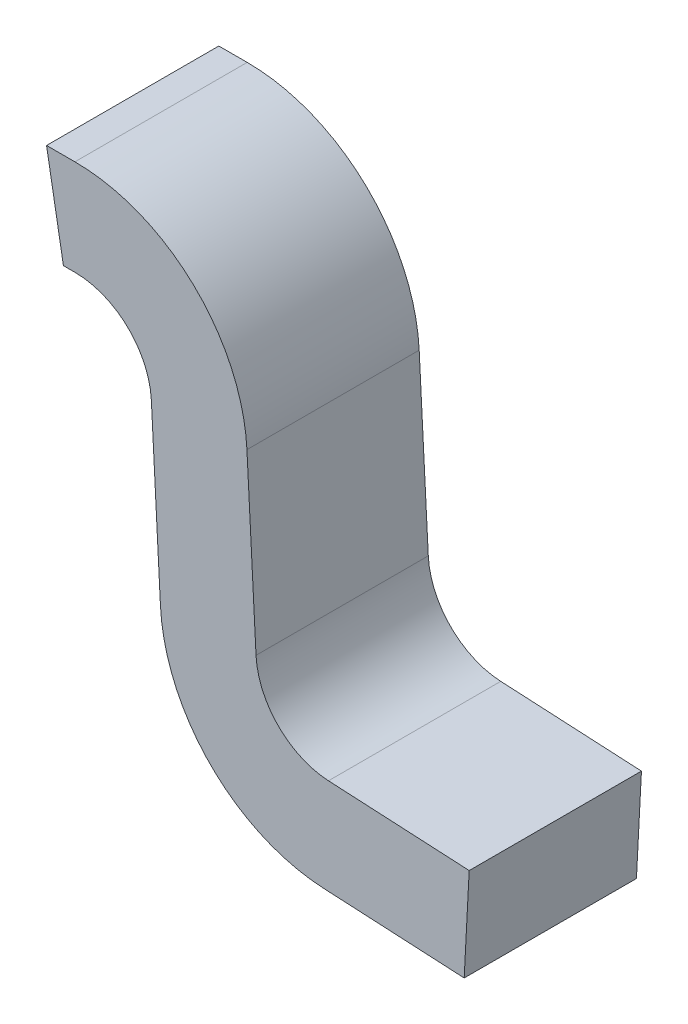
ISO-10303-21;
HEADER;
FILE_DESCRIPTION(('STEP AP214'),'2;1');
FILE_NAME('part.step','',(''),(''),'','','');
FILE_SCHEMA(('AUTOMOTIVE_DESIGN { 1 0 10303 214 1 1 1 1 }'));
ENDSEC;
DATA;
#1=APPLICATION_CONTEXT('core data for automotive mechanical design processes');
#2=APPLICATION_PROTOCOL_DEFINITION('international standard','automotive_design',2000,#1);
#3=PRODUCT_CONTEXT('',#1,'mechanical');
#4=PRODUCT('Part','Part','',(#3));
#5=PRODUCT_RELATED_PRODUCT_CATEGORY('part','',(#4));
#6=PRODUCT_DEFINITION_FORMATION('','',#4);
#7=PRODUCT_DEFINITION_CONTEXT('part definition',#1,'design');
#8=PRODUCT_DEFINITION('design','',#6,#7);
#9=PRODUCT_DEFINITION_SHAPE('','',#8);
#10=(LENGTH_UNIT() NAMED_UNIT(*) SI_UNIT(.MILLI.,.METRE.));
#11=(NAMED_UNIT(*) PLANE_ANGLE_UNIT() SI_UNIT($,.RADIAN.));
#12=(NAMED_UNIT(*) SI_UNIT($,.STERADIAN.) SOLID_ANGLE_UNIT());
#13=UNCERTAINTY_MEASURE_WITH_UNIT(LENGTH_MEASURE(1.E-05),#10,'distance_accuracy_value','');
#14=(GEOMETRIC_REPRESENTATION_CONTEXT(3) GLOBAL_UNCERTAINTY_ASSIGNED_CONTEXT((#13)) GLOBAL_UNIT_ASSIGNED_CONTEXT((#10,
#11,#12)) REPRESENTATION_CONTEXT('',''));
#15=CARTESIAN_POINT('',(0.,0.,0.));
#16=DIRECTION('',(0.,0.,1.));
#17=DIRECTION('',(1.,0.,0.));
#18=AXIS2_PLACEMENT_3D('',#15,#16,#17);
#19=CARTESIAN_POINT('',(0.,0.,-1.4125));
#20=DIRECTION('',(0.,0.,1.));
#21=DIRECTION('',(1.,0.,0.));
#22=AXIS2_PLACEMENT_3D('',#19,#20,#21);
#23=PLANE('',#22);
#24=DIRECTION('',(-0.0523359562429177,0.998629534754575,0.));
#25=VECTOR('',#24,1.);
#26=CARTESIAN_POINT('',(0.861573213012,-0.31493822705,-1.4125));
#27=LINE('',#26,#25);
#28=CARTESIAN_POINT('',(0.861573213012008,-0.31493822705016,-1.4125));
#29=VERTEX_POINT('',#28);
#30=CARTESIAN_POINT('',(0.849691645319655,-0.0882244098453541,-1.4125));
#31=VERTEX_POINT('',#30);
#32=EDGE_CURVE('E144',#29,#31,#27,.T.);
#33=ORIENTED_EDGE('',*,*,#32,.F.);
#34=CARTESIAN_POINT('',(0.961436166488,-0.309704631426,-1.4125));
#35=DIRECTION('',(0.,0.,1.));
#36=DIRECTION('',(1.,0.,0.));
#37=AXIS2_PLACEMENT_3D('',#34,#35,#36);
#38=CIRCLE('',#37,0.1);
#39=CARTESIAN_POINT('',(0.956202570863354,-0.40956758490123,-1.4125));
#40=VERTEX_POINT('',#39);
#41=EDGE_CURVE('E151',#29,#40,#38,.T.);
#42=ORIENTED_EDGE('',*,*,#41,.T.);
#43=DIRECTION('',(-0.998629534754575,0.0523359562429177,0.));
#44=VECTOR('',#43,1.);
#45=CARTESIAN_POINT('',(1.14,-0.4192,-1.4125));
#46=LINE('',#45,#44);
#47=CARTESIAN_POINT('',(1.14000000000012,-0.419200000000006,-1.4125));
#48=VERTEX_POINT('',#47);
#49=EDGE_CURVE('E148',#48,#40,#46,.T.);
#50=ORIENTED_EDGE('',*,*,#49,.F.);
#51=DIRECTION('',(0.0523359562429177,0.998629534754575,0.));
#52=VECTOR('',#51,1.);
#53=CARTESIAN_POINT('',(1.13345800547,-0.544028691844,-1.4125));
#54=LINE('',#53,#52);
#55=CARTESIAN_POINT('',(1.13345800547,-0.544028691843999,-1.4125));
#56=VERTEX_POINT('',#55);
#57=EDGE_CURVE('E155',#56,#48,#54,.T.);
#58=ORIENTED_EDGE('',*,*,#57,.F.);
#59=DIRECTION('',(0.998629534754575,-0.0523359562429177,0.));
#60=VECTOR('',#59,1.);
#61=CARTESIAN_POINT('',(0.949660576333,-0.534396276745,-1.4125));
#62=LINE('',#61,#60);
#63=CARTESIAN_POINT('',(0.949660576333192,-0.53439627674501,-1.4125));
#64=VERTEX_POINT('',#63);
#65=EDGE_CURVE('E160',#64,#56,#62,.T.);
#66=ORIENTED_EDGE('',*,*,#65,.F.);
#67=CARTESIAN_POINT('',(0.961436166488,-0.309704631426,-1.4125));
#68=DIRECTION('',(0.,0.,1.));
#69=DIRECTION('',(1.,0.,0.));
#70=AXIS2_PLACEMENT_3D('',#67,#68,#69);
#71=CIRCLE('',#70,0.225);
#72=CARTESIAN_POINT('',(0.736744521168336,-0.321480221580316,-1.4125));
#73=VERTEX_POINT('',#72);
#74=EDGE_CURVE('E117',#73,#64,#71,.T.);
#75=ORIENTED_EDGE('',*,*,#74,.F.);
#76=DIRECTION('',(0.0523359562429177,-0.998629534754575,0.));
#77=VECTOR('',#76,1.);
#78=CARTESIAN_POINT('',(0.724862953476,-0.09476640437571,-1.4125));
#79=LINE('',#78,#77);
#80=CARTESIAN_POINT('',(0.724862953475999,-0.0947664043756949,-1.4125));
#81=VERTEX_POINT('',#80);
#82=EDGE_CURVE('E114',#81,#73,#79,.T.);
#83=ORIENTED_EDGE('',*,*,#82,.F.);
#84=CARTESIAN_POINT('',(0.625,-0.1,-1.4125));
#85=DIRECTION('',(0.,0.,1.));
#86=DIRECTION('',(1.,0.,0.));
#87=AXIS2_PLACEMENT_3D('',#84,#85,#86);
#88=CIRCLE('',#87,0.1);
#89=CARTESIAN_POINT('',(0.625,0.,-1.4125));
#90=VERTEX_POINT('',#89);
#91=EDGE_CURVE('E20',#81,#90,#88,.T.);
#92=ORIENTED_EDGE('',*,*,#91,.T.);
#93=DIRECTION('',(1.,0.,0.));
#94=VECTOR('',#93,1.);
#95=CARTESIAN_POINT('',(0.61,0.,-1.4125));
#96=LINE('',#95,#94);
#97=CARTESIAN_POINT('',(0.609999999999862,0.,-1.4125));
#98=VERTEX_POINT('',#97);
#99=EDGE_CURVE('E132',#98,#90,#96,.T.);
#100=ORIENTED_EDGE('',*,*,#99,.F.);
#101=DIRECTION('',(0.173648177667033,-0.98480775301219,0.));
#102=VECTOR('',#101,1.);
#103=CARTESIAN_POINT('',(0.587959127411,0.125,-1.4125));
#104=LINE('',#103,#102);
#105=CARTESIAN_POINT('',(0.587959127411,0.125,-1.4125));
#106=VERTEX_POINT('',#105);
#107=EDGE_CURVE('E130',#106,#98,#104,.T.);
#108=ORIENTED_EDGE('',*,*,#107,.F.);
#109=DIRECTION('',(1.,0.,0.));
#110=VECTOR('',#109,1.);
#111=CARTESIAN_POINT('',(0.625,0.125,-1.4125));
#112=LINE('',#111,#110);
#113=CARTESIAN_POINT('',(0.625,0.125,-1.4125));
#114=VERTEX_POINT('',#113);
#115=EDGE_CURVE('E139',#114,#106,#112,.F.);
#116=ORIENTED_EDGE('',*,*,#115,.F.);
#117=CARTESIAN_POINT('',(0.625,-0.1,-1.4125));
#118=DIRECTION('',(0.,0.,1.));
#119=DIRECTION('',(1.,0.,0.));
#120=AXIS2_PLACEMENT_3D('',#117,#118,#119);
#121=CIRCLE('',#120,0.225);
#122=EDGE_CURVE('E180',#31,#114,#121,.T.);
#123=ORIENTED_EDGE('',*,*,#122,.F.);
#124=EDGE_LOOP('',(#33,#42,#50,#58,#66,#75,#83,#92,#100,#108,#116,#123));
#125=FACE_BOUND('',#124,.T.);
#126=ADVANCED_FACE('F17',(#125),#23,.F.);
#127=CARTESIAN_POINT('',(0.625,-0.1,-1.4125));
#128=DIRECTION('',(0.,0.,1.));
#129=DIRECTION('',(1.,0.,0.));
#130=AXIS2_PLACEMENT_3D('',#127,#128,#129);
#131=CYLINDRICAL_SURFACE('',#130,0.1);
#132=CARTESIAN_POINT('',(0.625,-0.1,-1.1875));
#133=DIRECTION('',(0.,0.,1.));
#134=DIRECTION('',(1.,0.,0.));
#135=AXIS2_PLACEMENT_3D('',#132,#133,#134);
#136=CIRCLE('',#135,0.1);
#137=CARTESIAN_POINT('',(0.625,0.,-1.1875));
#138=VERTEX_POINT('',#137);
#139=CARTESIAN_POINT('',(0.724862953476004,-0.0947664043757943,-1.1875));
#140=VERTEX_POINT('',#139);
#141=EDGE_CURVE('E178',#138,#140,#136,.F.);
#142=ORIENTED_EDGE('',*,*,#141,.F.);
#143=DIRECTION('',(0.,0.,-1.));
#144=VECTOR('',#143,1.);
#145=CARTESIAN_POINT('',(0.625,0.,-1.4125));
#146=LINE('',#145,#144);
#147=EDGE_CURVE('E110',#90,#138,#146,.F.);
#148=ORIENTED_EDGE('',*,*,#147,.F.);
#149=ORIENTED_EDGE('',*,*,#91,.F.);
#150=DIRECTION('',(0.,0.,1.));
#151=VECTOR('',#150,1.);
#152=CARTESIAN_POINT('',(0.724862953476,-0.09476640437571,-1.4125));
#153=LINE('',#152,#151);
#154=EDGE_CURVE('E107',#140,#81,#153,.F.);
#155=ORIENTED_EDGE('',*,*,#154,.F.);
#156=EDGE_LOOP('',(#142,#148,#149,#155));
#157=FACE_BOUND('',#156,.T.);
#158=ADVANCED_FACE('F105',(#157),#131,.F.);
#159=CARTESIAN_POINT('',(0.724862953476,-0.09476640437571,-1.4125));
#160=DIRECTION('',(-0.998629534754575,-0.0523359562429177,0.));
#161=DIRECTION('',(0.0523359562429177,-0.998629534754575,0.));
#162=AXIS2_PLACEMENT_3D('',#159,#160,#161);
#163=PLANE('',#162);
#164=ORIENTED_EDGE('',*,*,#154,.T.);
#165=ORIENTED_EDGE('',*,*,#82,.T.);
#166=DIRECTION('',(0.,0.,1.));
#167=VECTOR('',#166,1.);
#168=CARTESIAN_POINT('',(0.736744521168186,-0.32148022157999,-1.4125));
#169=LINE('',#168,#167);
#170=CARTESIAN_POINT('',(0.736744521168099,-0.321480221580105,-1.1875));
#171=VERTEX_POINT('',#170);
#172=EDGE_CURVE('E120',#171,#73,#169,.F.);
#173=ORIENTED_EDGE('',*,*,#172,.F.);
#174=DIRECTION('',(0.0523359562409312,-0.998629534754679,0.));
#175=VECTOR('',#174,1.);
#176=CARTESIAN_POINT('',(0.724862953476,-0.09476640437571,-1.1875));
#177=LINE('',#176,#175);
#178=EDGE_CURVE('E124',#140,#171,#177,.T.);
#179=ORIENTED_EDGE('',*,*,#178,.F.);
#180=EDGE_LOOP('',(#164,#165,#173,#179));
#181=FACE_BOUND('',#180,.T.);
#182=ADVANCED_FACE('F122',(#181),#163,.T.);
#183=CARTESIAN_POINT('',(0.961436166488,-0.309704631426,-1.4125));
#184=DIRECTION('',(0.,0.,1.));
#185=DIRECTION('',(1.,0.,0.));
#186=AXIS2_PLACEMENT_3D('',#183,#184,#185);
#187=CYLINDRICAL_SURFACE('',#186,0.225);
#188=ORIENTED_EDGE('',*,*,#172,.T.);
#189=ORIENTED_EDGE('',*,*,#74,.T.);
#190=DIRECTION('',(0.,0.,1.));
#191=VECTOR('',#190,1.);
#192=CARTESIAN_POINT('',(0.949660576333,-0.534396276745,-1.4125));
#193=LINE('',#192,#191);
#194=CARTESIAN_POINT('',(0.94966057633319,-0.53439627674501,-1.1875));
#195=VERTEX_POINT('',#194);
#196=EDGE_CURVE('E162',#195,#64,#193,.F.);
#197=ORIENTED_EDGE('',*,*,#196,.F.);
#198=CARTESIAN_POINT('',(0.961436166488,-0.309704631426,-1.1875));
#199=DIRECTION('',(0.,0.,1.));
#200=DIRECTION('',(1.,0.,0.));
#201=AXIS2_PLACEMENT_3D('',#198,#199,#200);
#202=CIRCLE('',#201,0.225);
#203=EDGE_CURVE('E174',#171,#195,#202,.T.);
#204=ORIENTED_EDGE('',*,*,#203,.F.);
#205=EDGE_LOOP('',(#188,#189,#197,#204));
#206=FACE_BOUND('',#205,.T.);
#207=ADVANCED_FACE('F186',(#206),#187,.T.);
#208=CARTESIAN_POINT('',(0.949660576333,-0.534396276745,-1.4125));
#209=DIRECTION('',(-0.0523359562429177,-0.998629534754575,0.));
#210=DIRECTION('',(0.998629534754575,-0.0523359562429177,0.));
#211=AXIS2_PLACEMENT_3D('',#208,#209,#210);
#212=PLANE('',#211);
#213=ORIENTED_EDGE('',*,*,#196,.T.);
#214=ORIENTED_EDGE('',*,*,#65,.T.);
#215=DIRECTION('',(0.,0.,1.));
#216=VECTOR('',#215,1.);
#217=CARTESIAN_POINT('',(1.13345800547,-0.544028691844,-1.4125));
#218=LINE('',#217,#216);
#219=CARTESIAN_POINT('',(1.13345800547,-0.544028691844,-1.1875));
#220=VERTEX_POINT('',#219);
#221=EDGE_CURVE('E157',#220,#56,#218,.F.);
#222=ORIENTED_EDGE('',*,*,#221,.F.);
#223=DIRECTION('',(0.998629534754574,-0.0523359562429318,0.));
#224=VECTOR('',#223,1.);
#225=CARTESIAN_POINT('',(0.949660576333,-0.534396276745,-1.1875));
#226=LINE('',#225,#224);
#227=EDGE_CURVE('E177',#195,#220,#226,.T.);
#228=ORIENTED_EDGE('',*,*,#227,.F.);
#229=EDGE_LOOP('',(#213,#214,#222,#228));
#230=FACE_BOUND('',#229,.T.);
#231=ADVANCED_FACE('F233',(#230),#212,.T.);
#232=CARTESIAN_POINT('',(1.13345800547,-0.544028691844,-1.4125));
#233=DIRECTION('',(0.998629534754575,-0.0523359562429177,0.));
#234=DIRECTION('',(0.0523359562429177,0.998629534754575,0.));
#235=AXIS2_PLACEMENT_3D('',#232,#233,#234);
#236=PLANE('',#235);
#237=ORIENTED_EDGE('',*,*,#221,.T.);
#238=ORIENTED_EDGE('',*,*,#57,.T.);
#239=DIRECTION('',(0.,0.,1.));
#240=VECTOR('',#239,1.);
#241=CARTESIAN_POINT('',(1.14,-0.4192,-1.4125));
#242=LINE('',#241,#240);
#243=CARTESIAN_POINT('',(1.14,-0.4192,-1.1875));
#244=VERTEX_POINT('',#243);
#245=EDGE_CURVE('E152',#244,#48,#242,.F.);
#246=ORIENTED_EDGE('',*,*,#245,.F.);
#247=DIRECTION('',(0.0523359562401418,0.998629534754721,0.));
#248=VECTOR('',#247,1.);
#249=CARTESIAN_POINT('',(1.13345800547,-0.544028691844,-1.1875));
#250=LINE('',#249,#248);
#251=EDGE_CURVE('E219',#220,#244,#250,.T.);
#252=ORIENTED_EDGE('',*,*,#251,.F.);
#253=EDGE_LOOP('',(#237,#238,#246,#252));
#254=FACE_BOUND('',#253,.T.);
#255=ADVANCED_FACE('F229',(#254),#236,.T.);
#256=CARTESIAN_POINT('',(1.14,-0.4192,-1.4125));
#257=DIRECTION('',(0.0523359562429177,0.998629534754575,0.));
#258=DIRECTION('',(-0.998629534754575,0.0523359562429177,0.));
#259=AXIS2_PLACEMENT_3D('',#256,#257,#258);
#260=PLANE('',#259);
#261=ORIENTED_EDGE('',*,*,#245,.T.);
#262=ORIENTED_EDGE('',*,*,#49,.T.);
#263=DIRECTION('',(0.,0.,1.));
#264=VECTOR('',#263,1.);
#265=CARTESIAN_POINT('',(0.956202570862978,-0.409567584901419,-1.4125));
#266=LINE('',#265,#264);
#267=CARTESIAN_POINT('',(0.956202570863353,-0.409567584901229,-1.1875));
#268=VERTEX_POINT('',#267);
#269=EDGE_CURVE('E182',#40,#268,#266,.T.);
#270=ORIENTED_EDGE('',*,*,#269,.T.);
#271=DIRECTION('',(-0.998629534754574,0.0523359562429318,0.));
#272=VECTOR('',#271,1.);
#273=CARTESIAN_POINT('',(1.14,-0.4192,-1.1875));
#274=LINE('',#273,#272);
#275=EDGE_CURVE('E173',#244,#268,#274,.T.);
#276=ORIENTED_EDGE('',*,*,#275,.F.);
#277=EDGE_LOOP('',(#261,#262,#270,#276));
#278=FACE_BOUND('',#277,.T.);
#279=ADVANCED_FACE('F237',(#278),#260,.T.);
#280=CARTESIAN_POINT('',(0.961436166488,-0.309704631426,-1.4125));
#281=DIRECTION('',(0.,0.,1.));
#282=DIRECTION('',(1.,0.,0.));
#283=AXIS2_PLACEMENT_3D('',#280,#281,#282);
#284=CYLINDRICAL_SURFACE('',#283,0.1);
#285=CARTESIAN_POINT('',(0.961436166488,-0.309704631426,-1.1875));
#286=DIRECTION('',(0.,0.,1.));
#287=DIRECTION('',(1.,0.,0.));
#288=AXIS2_PLACEMENT_3D('',#285,#286,#287);
#289=CIRCLE('',#288,0.1);
#290=CARTESIAN_POINT('',(0.861573213012003,-0.314938227050056,-1.1875));
#291=VERTEX_POINT('',#290);
#292=EDGE_CURVE('E170',#268,#291,#289,.F.);
#293=ORIENTED_EDGE('',*,*,#292,.F.);
#294=ORIENTED_EDGE('',*,*,#269,.F.);
#295=ORIENTED_EDGE('',*,*,#41,.F.);
#296=DIRECTION('',(0.,0.,1.));
#297=VECTOR('',#296,1.);
#298=CARTESIAN_POINT('',(0.861573213012,-0.31493822705,-1.4125));
#299=LINE('',#298,#297);
#300=EDGE_CURVE('E147',#291,#29,#299,.F.);
#301=ORIENTED_EDGE('',*,*,#300,.F.);
#302=EDGE_LOOP('',(#293,#294,#295,#301));
#303=FACE_BOUND('',#302,.T.);
#304=ADVANCED_FACE('F312',(#303),#284,.F.);
#305=CARTESIAN_POINT('',(0.861573213012,-0.31493822705,-1.4125));
#306=DIRECTION('',(0.998629534754575,0.0523359562429177,0.));
#307=DIRECTION('',(-0.0523359562429177,0.998629534754575,0.));
#308=AXIS2_PLACEMENT_3D('',#305,#306,#307);
#309=PLANE('',#308);
#310=ORIENTED_EDGE('',*,*,#300,.T.);
#311=ORIENTED_EDGE('',*,*,#32,.T.);
#312=DIRECTION('',(0.,0.,1.));
#313=VECTOR('',#312,1.);
#314=CARTESIAN_POINT('',(0.84969164531978,-0.0882244098453515,-1.4125));
#315=LINE('',#314,#313);
#316=CARTESIAN_POINT('',(0.849691645319902,-0.0882244098455748,-1.1875));
#317=VERTEX_POINT('',#316);
#318=EDGE_CURVE('E146',#317,#31,#315,.F.);
#319=ORIENTED_EDGE('',*,*,#318,.F.);
#320=DIRECTION('',(-0.052335956240846,0.998629534754684,0.));
#321=VECTOR('',#320,1.);
#322=CARTESIAN_POINT('',(0.861573213012,-0.31493822705,-1.1875));
#323=LINE('',#322,#321);
#324=EDGE_CURVE('E169',#291,#317,#323,.T.);
#325=ORIENTED_EDGE('',*,*,#324,.F.);
#326=EDGE_LOOP('',(#310,#311,#319,#325));
#327=FACE_BOUND('',#326,.T.);
#328=ADVANCED_FACE('F302',(#327),#309,.T.);
#329=CARTESIAN_POINT('',(0.625,-0.1,-1.4125));
#330=DIRECTION('',(0.,0.,1.));
#331=DIRECTION('',(1.,0.,0.));
#332=AXIS2_PLACEMENT_3D('',#329,#330,#331);
#333=CYLINDRICAL_SURFACE('',#332,0.225);
#334=ORIENTED_EDGE('',*,*,#318,.T.);
#335=ORIENTED_EDGE('',*,*,#122,.T.);
#336=DIRECTION('',(0.,0.,1.));
#337=VECTOR('',#336,1.);
#338=CARTESIAN_POINT('',(0.625,0.125,-1.4125));
#339=LINE('',#338,#337);
#340=CARTESIAN_POINT('',(0.625,0.125,-1.1875));
#341=VERTEX_POINT('',#340);
#342=EDGE_CURVE('E141',#341,#114,#339,.F.);
#343=ORIENTED_EDGE('',*,*,#342,.F.);
#344=CARTESIAN_POINT('',(0.625,-0.1,-1.1875));
#345=DIRECTION('',(0.,0.,1.));
#346=DIRECTION('',(1.,0.,0.));
#347=AXIS2_PLACEMENT_3D('',#344,#345,#346);
#348=CIRCLE('',#347,0.225);
#349=EDGE_CURVE('E165',#317,#341,#348,.T.);
#350=ORIENTED_EDGE('',*,*,#349,.F.);
#351=EDGE_LOOP('',(#334,#335,#343,#350));
#352=FACE_BOUND('',#351,.T.);
#353=ADVANCED_FACE('F268',(#352),#333,.T.);
#354=CARTESIAN_POINT('',(0.625,0.125,-1.4125));
#355=DIRECTION('',(0.,1.,0.));
#356=DIRECTION('',(0.,0.,1.));
#357=AXIS2_PLACEMENT_3D('',#354,#355,#356);
#358=PLANE('',#357);
#359=DIRECTION('',(0.,0.,1.));
#360=VECTOR('',#359,1.);
#361=CARTESIAN_POINT('',(0.587959127411,0.125,-1.4125));
#362=LINE('',#361,#360);
#363=CARTESIAN_POINT('',(0.587959127411,0.125,-1.1875));
#364=VERTEX_POINT('',#363);
#365=EDGE_CURVE('E133',#364,#106,#362,.F.);
#366=ORIENTED_EDGE('',*,*,#365,.F.);
#367=DIRECTION('',(1.,0.,0.));
#368=VECTOR('',#367,1.);
#369=CARTESIAN_POINT('',(0.,0.125,-1.1875));
#370=LINE('',#369,#368);
#371=EDGE_CURVE('E168',#341,#364,#370,.F.);
#372=ORIENTED_EDGE('',*,*,#371,.F.);
#373=ORIENTED_EDGE('',*,*,#342,.T.);
#374=ORIENTED_EDGE('',*,*,#115,.T.);
#375=EDGE_LOOP('',(#366,#372,#373,#374));
#376=FACE_BOUND('',#375,.T.);
#377=ADVANCED_FACE('F254',(#376),#358,.T.);
#378=CARTESIAN_POINT('',(0.587959127411,0.125,-1.4125));
#379=DIRECTION('',(-0.98480775301219,-0.173648177667033,0.));
#380=DIRECTION('',(0.173648177667033,-0.98480775301219,0.));
#381=AXIS2_PLACEMENT_3D('',#378,#379,#380);
#382=PLANE('',#381);
#383=ORIENTED_EDGE('',*,*,#107,.T.);
#384=DIRECTION('',(0.,0.,-1.));
#385=VECTOR('',#384,1.);
#386=CARTESIAN_POINT('',(0.61,0.,-1.4125));
#387=LINE('',#386,#385);
#388=CARTESIAN_POINT('',(0.61,0.,-1.1875));
#389=VERTEX_POINT('',#388);
#390=EDGE_CURVE('E35',#389,#98,#387,.T.);
#391=ORIENTED_EDGE('',*,*,#390,.F.);
#392=DIRECTION('',(0.173648177670306,-0.984807753011613,0.));
#393=VECTOR('',#392,1.);
#394=CARTESIAN_POINT('',(0.587959127411,0.125,-1.1875));
#395=LINE('',#394,#393);
#396=EDGE_CURVE('E26',#364,#389,#395,.T.);
#397=ORIENTED_EDGE('',*,*,#396,.F.);
#398=ORIENTED_EDGE('',*,*,#365,.T.);
#399=EDGE_LOOP('',(#383,#391,#397,#398));
#400=FACE_BOUND('',#399,.T.);
#401=ADVANCED_FACE('F257',(#400),#382,.T.);
#402=CARTESIAN_POINT('',(0.61,0.,-1.4125));
#403=DIRECTION('',(0.,-1.,0.));
#404=DIRECTION('',(0.,0.,-1.));
#405=AXIS2_PLACEMENT_3D('',#402,#403,#404);
#406=PLANE('',#405);
#407=DIRECTION('',(1.,0.,0.));
#408=VECTOR('',#407,1.);
#409=CARTESIAN_POINT('',(0.,0.,-1.1875));
#410=LINE('',#409,#408);
#411=EDGE_CURVE('E11',#389,#138,#410,.T.);
#412=ORIENTED_EDGE('',*,*,#411,.F.);
#413=ORIENTED_EDGE('',*,*,#390,.T.);
#414=ORIENTED_EDGE('',*,*,#99,.T.);
#415=ORIENTED_EDGE('',*,*,#147,.T.);
#416=EDGE_LOOP('',(#412,#413,#414,#415));
#417=FACE_BOUND('',#416,.T.);
#418=ADVANCED_FACE('F259',(#417),#406,.T.);
#419=CARTESIAN_POINT('',(0.,0.,-1.1875));
#420=DIRECTION('',(0.,0.,1.));
#421=DIRECTION('',(1.,0.,0.));
#422=AXIS2_PLACEMENT_3D('',#419,#420,#421);
#423=PLANE('',#422);
#424=ORIENTED_EDGE('',*,*,#396,.T.);
#425=ORIENTED_EDGE('',*,*,#411,.T.);
#426=ORIENTED_EDGE('',*,*,#141,.T.);
#427=ORIENTED_EDGE('',*,*,#178,.T.);
#428=ORIENTED_EDGE('',*,*,#203,.T.);
#429=ORIENTED_EDGE('',*,*,#227,.T.);
#430=ORIENTED_EDGE('',*,*,#251,.T.);
#431=ORIENTED_EDGE('',*,*,#275,.T.);
#432=ORIENTED_EDGE('',*,*,#292,.T.);
#433=ORIENTED_EDGE('',*,*,#324,.T.);
#434=ORIENTED_EDGE('',*,*,#349,.T.);
#435=ORIENTED_EDGE('',*,*,#371,.T.);
#436=EDGE_LOOP('',(#424,#425,#426,#427,#428,#429,#430,#431,#432,#433,#434,#435));
#437=FACE_BOUND('',#436,.T.);
#438=ADVANCED_FACE('F191',(#437),#423,.T.);
#439=CLOSED_SHELL('',(#126,#158,#182,#207,#231,#255,#279,#304,#328,#353,#377,#401,#418,#438));
#440=MANIFOLD_SOLID_BREP('B1',#439);
#441=ADVANCED_BREP_SHAPE_REPRESENTATION('',(#18,#440),#14);
#442=SHAPE_DEFINITION_REPRESENTATION(#9,#441);
ENDSEC;
END-ISO-10303-21;
